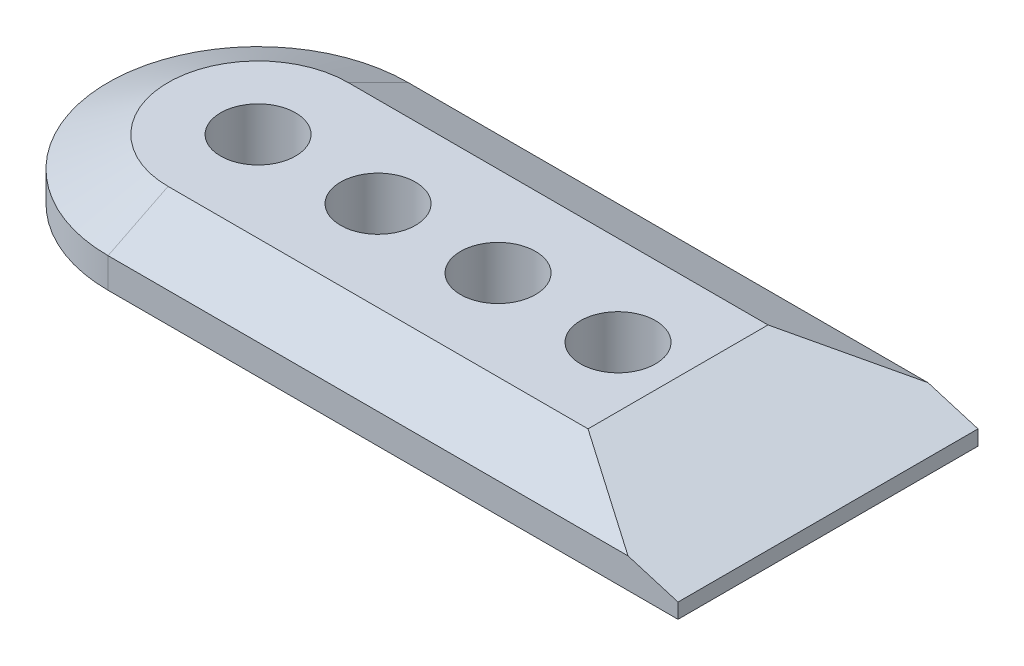
ISO-10303-21;
HEADER;
FILE_DESCRIPTION(('STEP AP214'),'2;1');
FILE_NAME('part.step','',(''),(''),'','','');
FILE_SCHEMA(('AUTOMOTIVE_DESIGN { 1 0 10303 214 1 1 1 1 }'));
ENDSEC;
DATA;
#1=APPLICATION_CONTEXT('core data for automotive mechanical design processes');
#2=APPLICATION_PROTOCOL_DEFINITION('international standard','automotive_design',2000,#1);
#3=PRODUCT_CONTEXT('',#1,'mechanical');
#4=PRODUCT('Part','Part','',(#3));
#5=PRODUCT_RELATED_PRODUCT_CATEGORY('part','',(#4));
#6=PRODUCT_DEFINITION_FORMATION('','',#4);
#7=PRODUCT_DEFINITION_CONTEXT('part definition',#1,'design');
#8=PRODUCT_DEFINITION('design','',#6,#7);
#9=PRODUCT_DEFINITION_SHAPE('','',#8);
#10=(LENGTH_UNIT() NAMED_UNIT(*) SI_UNIT(.MILLI.,.METRE.));
#11=(NAMED_UNIT(*) PLANE_ANGLE_UNIT() SI_UNIT($,.RADIAN.));
#12=(NAMED_UNIT(*) SI_UNIT($,.STERADIAN.) SOLID_ANGLE_UNIT());
#13=UNCERTAINTY_MEASURE_WITH_UNIT(LENGTH_MEASURE(1.E-05),#10,'distance_accuracy_value','');
#14=(GEOMETRIC_REPRESENTATION_CONTEXT(3) GLOBAL_UNCERTAINTY_ASSIGNED_CONTEXT((#13)) GLOBAL_UNIT_ASSIGNED_CONTEXT((#10,
#11,#12)) REPRESENTATION_CONTEXT('',''));
#15=CARTESIAN_POINT('',(0.,0.,0.));
#16=DIRECTION('',(0.,0.,1.));
#17=DIRECTION('',(1.,0.,0.));
#18=AXIS2_PLACEMENT_3D('',#15,#16,#17);
#19=CARTESIAN_POINT('',(0.,12.7,0.));
#20=DIRECTION('',(0.,-1.,0.));
#21=DIRECTION('',(0.,0.,-1.));
#22=AXIS2_PLACEMENT_3D('',#19,#20,#21);
#23=CYLINDRICAL_SURFACE('',#22,31.75);
#24=DIRECTION('',(0.,-1.,0.));
#25=VECTOR('',#24,1.);
#26=CARTESIAN_POINT('',(0.,12.7,31.75));
#27=LINE('',#26,#25);
#28=CARTESIAN_POINT('',(0.,6.34999999999997,31.75));
#29=VERTEX_POINT('',#28);
#30=CARTESIAN_POINT('',(0.,0.,31.75));
#31=VERTEX_POINT('',#30);
#32=EDGE_CURVE('E126',#29,#31,#27,.T.);
#33=ORIENTED_EDGE('',*,*,#32,.F.);
#34=CARTESIAN_POINT('',(0.,6.34999999999997,0.));
#35=DIRECTION('',(0.,-1.,0.));
#36=DIRECTION('',(0.,0.,-1.));
#37=AXIS2_PLACEMENT_3D('',#34,#35,#36);
#38=CIRCLE('',#37,31.75);
#39=CARTESIAN_POINT('',(0.,6.34999999999997,-31.75));
#40=VERTEX_POINT('',#39);
#41=EDGE_CURVE('E99',#29,#40,#38,.T.);
#42=ORIENTED_EDGE('',*,*,#41,.T.);
#43=DIRECTION('',(0.,-1.,0.));
#44=VECTOR('',#43,1.);
#45=CARTESIAN_POINT('',(0.,12.7,-31.75));
#46=LINE('',#45,#44);
#47=CARTESIAN_POINT('',(0.,0.,-31.75));
#48=VERTEX_POINT('',#47);
#49=EDGE_CURVE('E92',#40,#48,#46,.T.);
#50=ORIENTED_EDGE('',*,*,#49,.T.);
#51=CARTESIAN_POINT('',(0.,0.,0.));
#52=DIRECTION('',(0.,-1.,0.));
#53=DIRECTION('',(0.,0.,-1.));
#54=AXIS2_PLACEMENT_3D('',#51,#52,#53);
#55=CIRCLE('',#54,31.75);
#56=EDGE_CURVE('E96',#31,#48,#55,.T.);
#57=ORIENTED_EDGE('',*,*,#56,.F.);
#58=EDGE_LOOP('',(#33,#42,#50,#57));
#59=FACE_BOUND('',#58,.T.);
#60=ADVANCED_FACE('F33',(#59),#23,.T.);
#61=CARTESIAN_POINT('',(120.65,12.7,31.75));
#62=DIRECTION('',(0.,0.,1.));
#63=DIRECTION('',(1.,0.,0.));
#64=AXIS2_PLACEMENT_3D('',#61,#62,#63);
#65=PLANE('',#64);
#66=DIRECTION('',(0.,-1.,0.));
#67=VECTOR('',#66,1.);
#68=CARTESIAN_POINT('',(120.65,12.7,31.75));
#69=LINE('',#68,#67);
#70=CARTESIAN_POINT('',(120.65,3.17499999999999,31.75));
#71=VERTEX_POINT('',#70);
#72=CARTESIAN_POINT('',(120.65,0.,31.75));
#73=VERTEX_POINT('',#72);
#74=EDGE_CURVE('E129',#71,#73,#69,.T.);
#75=ORIENTED_EDGE('',*,*,#74,.F.);
#76=DIRECTION('',(-0.957826285221152,0.287347885566343,0.));
#77=VECTOR('',#76,1.);
#78=CARTESIAN_POINT('',(118.028440366973,3.96146788990823,31.75));
#79=LINE('',#78,#77);
#80=CARTESIAN_POINT('',(110.066666666667,6.34999999999997,31.75));
#81=VERTEX_POINT('',#80);
#82=EDGE_CURVE('E148',#71,#81,#79,.T.);
#83=ORIENTED_EDGE('',*,*,#82,.T.);
#84=DIRECTION('',(-1.,0.,0.));
#85=VECTOR('',#84,1.);
#86=CARTESIAN_POINT('',(0.,6.34999999999997,31.75));
#87=LINE('',#86,#85);
#88=EDGE_CURVE('E128',#81,#29,#87,.T.);
#89=ORIENTED_EDGE('',*,*,#88,.T.);
#90=ORIENTED_EDGE('',*,*,#32,.T.);
#91=DIRECTION('',(-1.,0.,0.));
#92=VECTOR('',#91,1.);
#93=CARTESIAN_POINT('',(120.65,0.,31.75));
#94=LINE('',#93,#92);
#95=EDGE_CURVE('E102',#73,#31,#94,.T.);
#96=ORIENTED_EDGE('',*,*,#95,.F.);
#97=EDGE_LOOP('',(#75,#83,#89,#90,#96));
#98=FACE_BOUND('',#97,.T.);
#99=ADVANCED_FACE('F167',(#98),#65,.T.);
#100=CARTESIAN_POINT('',(120.65,12.7,-31.75));
#101=DIRECTION('',(1.,0.,0.));
#102=DIRECTION('',(0.,0.,-1.));
#103=AXIS2_PLACEMENT_3D('',#100,#101,#102);
#104=PLANE('',#103);
#105=DIRECTION('',(0.,-1.,0.));
#106=VECTOR('',#105,1.);
#107=CARTESIAN_POINT('',(120.65,12.7,-31.75));
#108=LINE('',#107,#106);
#109=CARTESIAN_POINT('',(120.65,3.17499999999999,-31.75));
#110=VERTEX_POINT('',#109);
#111=CARTESIAN_POINT('',(120.65,0.,-31.75));
#112=VERTEX_POINT('',#111);
#113=EDGE_CURVE('E101',#110,#112,#108,.T.);
#114=ORIENTED_EDGE('',*,*,#113,.F.);
#115=DIRECTION('',(0.,0.,1.));
#116=VECTOR('',#115,1.);
#117=CARTESIAN_POINT('',(120.65,3.17499999999999,19.0499999999999));
#118=LINE('',#117,#116);
#119=EDGE_CURVE('E142',#110,#71,#118,.T.);
#120=ORIENTED_EDGE('',*,*,#119,.T.);
#121=ORIENTED_EDGE('',*,*,#74,.T.);
#122=DIRECTION('',(0.,0.,1.));
#123=VECTOR('',#122,1.);
#124=CARTESIAN_POINT('',(120.65,0.,-31.75));
#125=LINE('',#124,#123);
#126=EDGE_CURVE('E111',#112,#73,#125,.T.);
#127=ORIENTED_EDGE('',*,*,#126,.F.);
#128=EDGE_LOOP('',(#114,#120,#121,#127));
#129=FACE_BOUND('',#128,.T.);
#130=ADVANCED_FACE('F164',(#129),#104,.T.);
#131=CARTESIAN_POINT('',(0.,12.7,-31.75));
#132=DIRECTION('',(0.,0.,-1.));
#133=DIRECTION('',(-1.,0.,0.));
#134=AXIS2_PLACEMENT_3D('',#131,#132,#133);
#135=PLANE('',#134);
#136=DIRECTION('',(1.,0.,0.));
#137=VECTOR('',#136,1.);
#138=CARTESIAN_POINT('',(120.65,6.34999999999997,-31.75));
#139=LINE('',#138,#137);
#140=CARTESIAN_POINT('',(110.066666666667,6.34999999999997,-31.75));
#141=VERTEX_POINT('',#140);
#142=EDGE_CURVE('E139',#40,#141,#139,.T.);
#143=ORIENTED_EDGE('',*,*,#142,.T.);
#144=DIRECTION('',(0.957826285221152,-0.287347885566343,0.));
#145=VECTOR('',#144,1.);
#146=CARTESIAN_POINT('',(7.3403669724769,37.1678899082566,-31.75));
#147=LINE('',#146,#145);
#148=EDGE_CURVE('E11',#141,#110,#147,.T.);
#149=ORIENTED_EDGE('',*,*,#148,.T.);
#150=ORIENTED_EDGE('',*,*,#113,.T.);
#151=DIRECTION('',(1.,0.,0.));
#152=VECTOR('',#151,1.);
#153=CARTESIAN_POINT('',(0.,0.,-31.75));
#154=LINE('',#153,#152);
#155=EDGE_CURVE('E105',#48,#112,#154,.T.);
#156=ORIENTED_EDGE('',*,*,#155,.F.);
#157=ORIENTED_EDGE('',*,*,#49,.F.);
#158=EDGE_LOOP('',(#143,#149,#150,#156,#157));
#159=FACE_BOUND('',#158,.T.);
#160=ADVANCED_FACE('F106',(#159),#135,.T.);
#161=CARTESIAN_POINT('',(0.,12.7,0.));
#162=DIRECTION('',(0.,-1.,0.));
#163=DIRECTION('',(0.,0.,-1.));
#164=AXIS2_PLACEMENT_3D('',#161,#162,#163);
#165=PLANE('',#164);
#166=CARTESIAN_POINT('',(0.,12.7,0.));
#167=DIRECTION('',(0.,1.,0.));
#168=DIRECTION('',(0.,0.,1.));
#169=AXIS2_PLACEMENT_3D('',#166,#167,#168);
#170=CIRCLE('',#169,7.9375);
#171=CARTESIAN_POINT('',(0.,12.7,7.9375));
#172=VERTEX_POINT('',#171);
#173=EDGE_CURVE('E265',#172,#172,#170,.T.);
#174=ORIENTED_EDGE('',*,*,#173,.F.);
#175=EDGE_LOOP('',(#174));
#176=FACE_BOUND('',#175,.T.);
#177=CARTESIAN_POINT('',(25.4,12.7,0.));
#178=DIRECTION('',(0.,1.,0.));
#179=DIRECTION('',(0.,0.,1.));
#180=AXIS2_PLACEMENT_3D('',#177,#178,#179);
#181=CIRCLE('',#180,7.9375);
#182=CARTESIAN_POINT('',(25.4,12.7,7.9375));
#183=VERTEX_POINT('',#182);
#184=EDGE_CURVE('E270',#183,#183,#181,.T.);
#185=ORIENTED_EDGE('',*,*,#184,.F.);
#186=EDGE_LOOP('',(#185));
#187=FACE_BOUND('',#186,.T.);
#188=CARTESIAN_POINT('',(50.8,12.7,0.));
#189=DIRECTION('',(0.,1.,0.));
#190=DIRECTION('',(0.,0.,1.));
#191=AXIS2_PLACEMENT_3D('',#188,#189,#190);
#192=CIRCLE('',#191,7.9375);
#193=CARTESIAN_POINT('',(50.8,12.7,7.9375));
#194=VERTEX_POINT('',#193);
#195=EDGE_CURVE('E278',#194,#194,#192,.T.);
#196=ORIENTED_EDGE('',*,*,#195,.F.);
#197=EDGE_LOOP('',(#196));
#198=FACE_BOUND('',#197,.T.);
#199=CARTESIAN_POINT('',(76.2,12.7,0.));
#200=DIRECTION('',(0.,1.,0.));
#201=DIRECTION('',(0.,0.,1.));
#202=AXIS2_PLACEMENT_3D('',#199,#200,#201);
#203=CIRCLE('',#202,7.93749999999999);
#204=CARTESIAN_POINT('',(76.2,12.7,7.93749999999999));
#205=VERTEX_POINT('',#204);
#206=EDGE_CURVE('E121',#205,#205,#203,.T.);
#207=ORIENTED_EDGE('',*,*,#206,.F.);
#208=EDGE_LOOP('',(#207));
#209=FACE_BOUND('',#208,.T.);
#210=DIRECTION('',(1.,0.,0.));
#211=VECTOR('',#210,1.);
#212=CARTESIAN_POINT('',(120.65,12.7,19.0499999999999));
#213=LINE('',#212,#211);
#214=CARTESIAN_POINT('',(0.,12.7,19.0499999999999));
#215=VERTEX_POINT('',#214);
#216=CARTESIAN_POINT('',(88.8999999999997,12.7,19.0499999999999));
#217=VERTEX_POINT('',#216);
#218=EDGE_CURVE('E137',#215,#217,#213,.T.);
#219=ORIENTED_EDGE('',*,*,#218,.T.);
#220=DIRECTION('',(0.,0.,-1.));
#221=VECTOR('',#220,1.);
#222=CARTESIAN_POINT('',(88.8999999999996,12.7,-19.0499999999999));
#223=LINE('',#222,#221);
#224=CARTESIAN_POINT('',(88.8999999999996,12.7,-19.0499999999999));
#225=VERTEX_POINT('',#224);
#226=EDGE_CURVE('E55',#217,#225,#223,.T.);
#227=ORIENTED_EDGE('',*,*,#226,.T.);
#228=DIRECTION('',(-1.,0.,0.));
#229=VECTOR('',#228,1.);
#230=CARTESIAN_POINT('',(0.,12.7,-19.0499999999999));
#231=LINE('',#230,#229);
#232=CARTESIAN_POINT('',(0.,12.7,-19.0499999999999));
#233=VERTEX_POINT('',#232);
#234=EDGE_CURVE('E135',#225,#233,#231,.T.);
#235=ORIENTED_EDGE('',*,*,#234,.T.);
#236=CARTESIAN_POINT('',(0.,12.7,0.));
#237=DIRECTION('',(0.,-1.,0.));
#238=DIRECTION('',(0.,0.,-1.));
#239=AXIS2_PLACEMENT_3D('',#236,#237,#238);
#240=CIRCLE('',#239,19.0499999999999);
#241=EDGE_CURVE('E133',#233,#215,#240,.F.);
#242=ORIENTED_EDGE('',*,*,#241,.T.);
#243=EDGE_LOOP('',(#219,#227,#235,#242));
#244=FACE_BOUND('',#243,.T.);
#245=ADVANCED_FACE('F159',(#176,#187,#198,#209,#244),#165,.F.);
#246=CARTESIAN_POINT('',(0.,0.,0.));
#247=DIRECTION('',(0.,-1.,0.));
#248=DIRECTION('',(0.,0.,-1.));
#249=AXIS2_PLACEMENT_3D('',#246,#247,#248);
#250=PLANE('',#249);
#251=CARTESIAN_POINT('',(0.,0.,0.));
#252=DIRECTION('',(0.,1.,0.));
#253=DIRECTION('',(0.,0.,1.));
#254=AXIS2_PLACEMENT_3D('',#251,#252,#253);
#255=CIRCLE('',#254,7.9375);
#256=CARTESIAN_POINT('',(0.,0.,7.9375));
#257=VERTEX_POINT('',#256);
#258=EDGE_CURVE('E144',#257,#257,#255,.T.);
#259=ORIENTED_EDGE('',*,*,#258,.T.);
#260=EDGE_LOOP('',(#259));
#261=FACE_BOUND('',#260,.T.);
#262=CARTESIAN_POINT('',(25.4,0.,0.));
#263=DIRECTION('',(0.,1.,0.));
#264=DIRECTION('',(0.,0.,1.));
#265=AXIS2_PLACEMENT_3D('',#262,#263,#264);
#266=CIRCLE('',#265,7.9375);
#267=CARTESIAN_POINT('',(25.4,0.,7.9375));
#268=VERTEX_POINT('',#267);
#269=EDGE_CURVE('E266',#268,#268,#266,.T.);
#270=ORIENTED_EDGE('',*,*,#269,.T.);
#271=EDGE_LOOP('',(#270));
#272=FACE_BOUND('',#271,.T.);
#273=CARTESIAN_POINT('',(50.8,0.,0.));
#274=DIRECTION('',(0.,1.,0.));
#275=DIRECTION('',(0.,0.,1.));
#276=AXIS2_PLACEMENT_3D('',#273,#274,#275);
#277=CIRCLE('',#276,7.9375);
#278=CARTESIAN_POINT('',(50.8,0.,7.9375));
#279=VERTEX_POINT('',#278);
#280=EDGE_CURVE('E275',#279,#279,#277,.T.);
#281=ORIENTED_EDGE('',*,*,#280,.T.);
#282=EDGE_LOOP('',(#281));
#283=FACE_BOUND('',#282,.T.);
#284=CARTESIAN_POINT('',(76.2,0.,0.));
#285=DIRECTION('',(0.,1.,0.));
#286=DIRECTION('',(0.,0.,1.));
#287=AXIS2_PLACEMENT_3D('',#284,#285,#286);
#288=CIRCLE('',#287,7.93749999999999);
#289=CARTESIAN_POINT('',(76.2,0.,7.93749999999999));
#290=VERTEX_POINT('',#289);
#291=EDGE_CURVE('E280',#290,#290,#288,.T.);
#292=ORIENTED_EDGE('',*,*,#291,.T.);
#293=EDGE_LOOP('',(#292));
#294=FACE_BOUND('',#293,.T.);
#295=ORIENTED_EDGE('',*,*,#56,.T.);
#296=ORIENTED_EDGE('',*,*,#155,.T.);
#297=ORIENTED_EDGE('',*,*,#126,.T.);
#298=ORIENTED_EDGE('',*,*,#95,.T.);
#299=EDGE_LOOP('',(#295,#296,#297,#298));
#300=FACE_BOUND('',#299,.T.);
#301=ADVANCED_FACE('F113',(#261,#272,#283,#294,#300),#250,.T.);
#302=CARTESIAN_POINT('',(0.,6.34999999999997,-31.75));
#303=DIRECTION('',(0.,0.894427190999917,-0.447213595499956));
#304=DIRECTION('',(-1.,0.,0.));
#305=AXIS2_PLACEMENT_3D('',#302,#303,#304);
#306=PLANE('',#305);
#307=ORIENTED_EDGE('',*,*,#234,.F.);
#308=DIRECTION('',(0.830454798537401,-0.249136439561218,-0.498272879122438));
#309=VECTOR('',#308,1.);
#310=CARTESIAN_POINT('',(34.1586206896549,29.1224137931033,13.7948275862068));
#311=LINE('',#310,#309);
#312=EDGE_CURVE('E41',#225,#141,#311,.T.);
#313=ORIENTED_EDGE('',*,*,#312,.T.);
#314=ORIENTED_EDGE('',*,*,#142,.F.);
#315=DIRECTION('',(0.,-0.447213595499956,-0.894427190999917));
#316=VECTOR('',#315,1.);
#317=CARTESIAN_POINT('',(0.,12.7,-19.0499999999999));
#318=LINE('',#317,#316);
#319=EDGE_CURVE('E115',#233,#40,#318,.T.);
#320=ORIENTED_EDGE('',*,*,#319,.F.);
#321=EDGE_LOOP('',(#307,#313,#314,#320));
#322=FACE_BOUND('',#321,.T.);
#323=ADVANCED_FACE('F171',(#322),#306,.T.);
#324=CARTESIAN_POINT('',(0.,6.34999999999997,0.));
#325=DIRECTION('',(0.,-1.,0.));
#326=DIRECTION('',(0.,0.,-1.));
#327=AXIS2_PLACEMENT_3D('',#324,#325,#326);
#328=CONICAL_SURFACE('',#327,31.75,1.10714871779409);
#329=ORIENTED_EDGE('',*,*,#319,.T.);
#330=ORIENTED_EDGE('',*,*,#41,.F.);
#331=DIRECTION('',(0.,-0.447213595499956,0.894427190999917));
#332=VECTOR('',#331,1.);
#333=CARTESIAN_POINT('',(0.,12.7,19.0499999999999));
#334=LINE('',#333,#332);
#335=EDGE_CURVE('E118',#215,#29,#334,.T.);
#336=ORIENTED_EDGE('',*,*,#335,.F.);
#337=ORIENTED_EDGE('',*,*,#241,.F.);
#338=EDGE_LOOP('',(#329,#330,#336,#337));
#339=FACE_BOUND('',#338,.T.);
#340=ADVANCED_FACE('F169',(#339),#328,.T.);
#341=CARTESIAN_POINT('',(120.65,6.34999999999997,31.75));
#342=DIRECTION('',(0.,0.894427190999917,0.447213595499956));
#343=DIRECTION('',(1.,0.,0.));
#344=AXIS2_PLACEMENT_3D('',#341,#342,#343);
#345=PLANE('',#344);
#346=ORIENTED_EDGE('',*,*,#88,.F.);
#347=DIRECTION('',(-0.830454798537401,0.249136439561218,-0.498272879122438));
#348=VECTOR('',#347,1.);
#349=CARTESIAN_POINT('',(117.365517241379,4.16034482758618,36.1293103448276));
#350=LINE('',#349,#348);
#351=EDGE_CURVE('E150',#81,#217,#350,.T.);
#352=ORIENTED_EDGE('',*,*,#351,.T.);
#353=ORIENTED_EDGE('',*,*,#218,.F.);
#354=ORIENTED_EDGE('',*,*,#335,.T.);
#355=EDGE_LOOP('',(#346,#352,#353,#354));
#356=FACE_BOUND('',#355,.T.);
#357=ADVANCED_FACE('F156',(#356),#345,.T.);
#358=CARTESIAN_POINT('',(120.65,3.17499999999999,-31.75));
#359=DIRECTION('',(0.287347885566343,0.957826285221152,0.));
#360=DIRECTION('',(0.,0.,-1.));
#361=AXIS2_PLACEMENT_3D('',#358,#359,#360);
#362=PLANE('',#361);
#363=ORIENTED_EDGE('',*,*,#312,.F.);
#364=ORIENTED_EDGE('',*,*,#226,.F.);
#365=ORIENTED_EDGE('',*,*,#351,.F.);
#366=ORIENTED_EDGE('',*,*,#82,.F.);
#367=ORIENTED_EDGE('',*,*,#119,.F.);
#368=ORIENTED_EDGE('',*,*,#148,.F.);
#369=EDGE_LOOP('',(#363,#364,#365,#366,#367,#368));
#370=FACE_BOUND('',#369,.T.);
#371=ADVANCED_FACE('F35',(#370),#362,.T.);
#372=CARTESIAN_POINT('',(76.2,0.,0.));
#373=DIRECTION('',(0.,1.,0.));
#374=DIRECTION('',(0.,0.,1.));
#375=AXIS2_PLACEMENT_3D('',#372,#373,#374);
#376=CYLINDRICAL_SURFACE('',#375,7.93749999999999);
#377=ORIENTED_EDGE('',*,*,#291,.F.);
#378=EDGE_LOOP('',(#377));
#379=FACE_BOUND('',#378,.T.);
#380=ORIENTED_EDGE('',*,*,#206,.T.);
#381=EDGE_LOOP('',(#380));
#382=FACE_BOUND('',#381,.T.);
#383=ADVANCED_FACE('F193',(#379,#382),#376,.F.);
#384=CARTESIAN_POINT('',(50.8,0.,0.));
#385=DIRECTION('',(0.,1.,0.));
#386=DIRECTION('',(0.,0.,1.));
#387=AXIS2_PLACEMENT_3D('',#384,#385,#386);
#388=CYLINDRICAL_SURFACE('',#387,7.9375);
#389=ORIENTED_EDGE('',*,*,#280,.F.);
#390=EDGE_LOOP('',(#389));
#391=FACE_BOUND('',#390,.T.);
#392=ORIENTED_EDGE('',*,*,#195,.T.);
#393=EDGE_LOOP('',(#392));
#394=FACE_BOUND('',#393,.T.);
#395=ADVANCED_FACE('F197',(#391,#394),#388,.F.);
#396=CARTESIAN_POINT('',(25.4,0.,0.));
#397=DIRECTION('',(0.,1.,0.));
#398=DIRECTION('',(0.,0.,1.));
#399=AXIS2_PLACEMENT_3D('',#396,#397,#398);
#400=CYLINDRICAL_SURFACE('',#399,7.9375);
#401=ORIENTED_EDGE('',*,*,#269,.F.);
#402=EDGE_LOOP('',(#401));
#403=FACE_BOUND('',#402,.T.);
#404=ORIENTED_EDGE('',*,*,#184,.T.);
#405=EDGE_LOOP('',(#404));
#406=FACE_BOUND('',#405,.T.);
#407=ADVANCED_FACE('F203',(#403,#406),#400,.F.);
#408=CARTESIAN_POINT('',(0.,0.,0.));
#409=DIRECTION('',(0.,1.,0.));
#410=DIRECTION('',(0.,0.,1.));
#411=AXIS2_PLACEMENT_3D('',#408,#409,#410);
#412=CYLINDRICAL_SURFACE('',#411,7.9375);
#413=ORIENTED_EDGE('',*,*,#258,.F.);
#414=EDGE_LOOP('',(#413));
#415=FACE_BOUND('',#414,.T.);
#416=ORIENTED_EDGE('',*,*,#173,.T.);
#417=EDGE_LOOP('',(#416));
#418=FACE_BOUND('',#417,.T.);
#419=ADVANCED_FACE('F247',(#415,#418),#412,.F.);
#420=CLOSED_SHELL('',(#60,#99,#130,#160,#245,#301,#323,#340,#357,#371,#383,#395,#407,#419));
#421=MANIFOLD_SOLID_BREP('B2',#420);
#422=ADVANCED_BREP_SHAPE_REPRESENTATION('',(#18,#421),#14);
#423=SHAPE_DEFINITION_REPRESENTATION(#9,#422);
ENDSEC;
END-ISO-10303-21;
